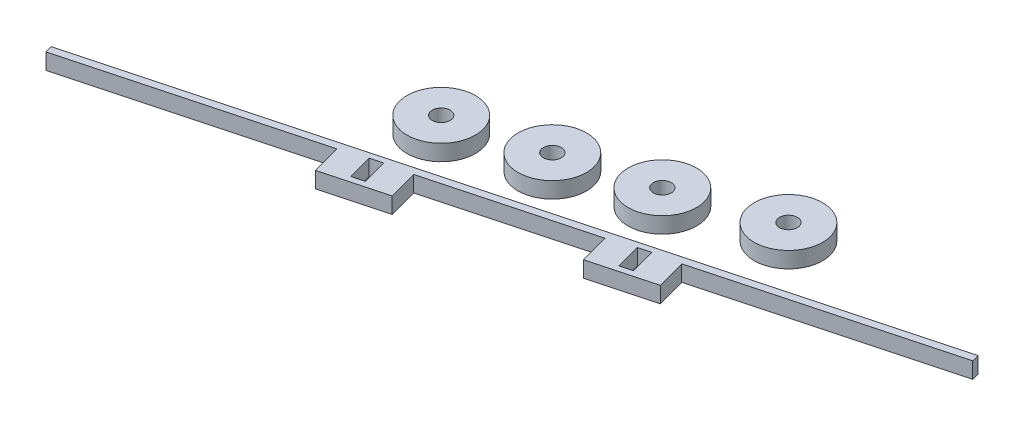
ISO-10303-21;
HEADER;
FILE_DESCRIPTION(('STEP AP214'),'2;1');
FILE_NAME('part.step','',(''),(''),'','','');
FILE_SCHEMA(('AUTOMOTIVE_DESIGN { 1 0 10303 214 1 1 1 1 }'));
ENDSEC;
DATA;
#1=APPLICATION_CONTEXT('core data for automotive mechanical design processes');
#2=APPLICATION_PROTOCOL_DEFINITION('international standard','automotive_design',2000,#1);
#3=PRODUCT_CONTEXT('',#1,'mechanical');
#4=PRODUCT('Part','Part','',(#3));
#5=PRODUCT_RELATED_PRODUCT_CATEGORY('part','',(#4));
#6=PRODUCT_DEFINITION_FORMATION('','',#4);
#7=PRODUCT_DEFINITION_CONTEXT('part definition',#1,'design');
#8=PRODUCT_DEFINITION('design','',#6,#7);
#9=PRODUCT_DEFINITION_SHAPE('','',#8);
#10=(LENGTH_UNIT() NAMED_UNIT(*) SI_UNIT(.MILLI.,.METRE.));
#11=(NAMED_UNIT(*) PLANE_ANGLE_UNIT() SI_UNIT($,.RADIAN.));
#12=(NAMED_UNIT(*) SI_UNIT($,.STERADIAN.) SOLID_ANGLE_UNIT());
#13=UNCERTAINTY_MEASURE_WITH_UNIT(LENGTH_MEASURE(1.E-05),#10,'distance_accuracy_value','');
#14=(GEOMETRIC_REPRESENTATION_CONTEXT(3) GLOBAL_UNCERTAINTY_ASSIGNED_CONTEXT((#13)) GLOBAL_UNIT_ASSIGNED_CONTEXT((#10,
#11,#12)) REPRESENTATION_CONTEXT('',''));
#15=CARTESIAN_POINT('',(0.,0.,0.));
#16=DIRECTION('',(0.,0.,1.));
#17=DIRECTION('',(1.,0.,0.));
#18=AXIS2_PLACEMENT_3D('',#15,#16,#17);
#19=CARTESIAN_POINT('',(-27.7966131715787,2.04191985143892,46.9858592361464));
#20=DIRECTION('',(0.25881904510306,0.,0.965925826288924));
#21=DIRECTION('',(-0.965925826288924,-7.24136028917854E-13,0.25881904510306));
#22=AXIS2_PLACEMENT_3D('',#19,#20,#21);
#23=PLANE('',#22);
#24=DIRECTION('',(0.965925826288924,7.24136028917854E-13,-0.25881904510306));
#25=VECTOR('',#24,1.);
#26=CARTESIAN_POINT('',(-27.7966131715824,7.42191985143892,46.9858592361474));
#27=LINE('',#26,#25);
#28=CARTESIAN_POINT('',(-155.994288836623,7.42191985141612,81.3363229022187));
#29=VERTEX_POINT('',#28);
#30=CARTESIAN_POINT('',(89.2929154911609,7.4219198515267,15.6118145887545));
#31=VERTEX_POINT('',#30);
#32=EDGE_CURVE('E326',#29,#31,#27,.T.);
#33=ORIENTED_EDGE('',*,*,#32,.T.);
#34=DIRECTION('',(-6.99461692078059E-13,1.,1.87420195529241E-13));
#35=VECTOR('',#34,1.);
#36=CARTESIAN_POINT('',(89.2929154911609,7.4219198515267,15.6118145887545));
#37=LINE('',#36,#35);
#38=CARTESIAN_POINT('',(89.2929154911647,2.04191985152669,15.6118145887535));
#39=VERTEX_POINT('',#38);
#40=EDGE_CURVE('E187',#39,#31,#37,.T.);
#41=ORIENTED_EDGE('',*,*,#40,.F.);
#42=DIRECTION('',(0.965925826288924,7.24136028917854E-13,-0.25881904510306));
#43=VECTOR('',#42,1.);
#44=CARTESIAN_POINT('',(-27.7966131715787,2.04191985143892,46.9858592361464));
#45=LINE('',#44,#43);
#46=CARTESIAN_POINT('',(-155.994288836623,2.04191985141612,81.3363229022187));
#47=VERTEX_POINT('',#46);
#48=EDGE_CURVE('E53',#47,#39,#45,.T.);
#49=ORIENTED_EDGE('',*,*,#48,.F.);
#50=DIRECTION('',(0.,-1.,0.));
#51=VECTOR('',#50,1.);
#52=CARTESIAN_POINT('',(-155.994288836623,2.04191985141612,81.3363229022187));
#53=LINE('',#52,#51);
#54=EDGE_CURVE('E185',#29,#47,#53,.T.);
#55=ORIENTED_EDGE('',*,*,#54,.F.);
#56=EDGE_LOOP('',(#33,#41,#49,#55));
#57=FACE_BOUND('',#56,.T.);
#58=ADVANCED_FACE('F45',(#57),#23,.F.);
#59=CARTESIAN_POINT('',(-24.5096112987698,2.04191985143892,59.2531172300158));
#60=DIRECTION('',(-0.25881904510306,0.,-0.965925826288924));
#61=DIRECTION('',(0.965925826288924,7.24136028917854E-13,-0.25881904510306));
#62=AXIS2_PLACEMENT_3D('',#59,#60,#61);
#63=PLANE('',#62);
#64=DIRECTION('',(-0.965925826288924,-7.24136028917854E-13,0.25881904510306));
#65=VECTOR('',#64,1.);
#66=CARTESIAN_POINT('',(-24.5096112987698,2.04191985143892,59.2531172300158));
#67=LINE('',#66,#65);
#68=CARTESIAN_POINT('',(15.5763104922205,2.04191985146897,48.5121268582388));
#69=VERTEX_POINT('',#68);
#70=CARTESIAN_POINT('',(-4.7081318598469,2.04191985145376,53.947326805403));
#71=VERTEX_POINT('',#70);
#72=EDGE_CURVE('E12',#69,#71,#67,.T.);
#73=ORIENTED_EDGE('',*,*,#72,.F.);
#74=DIRECTION('',(6.99461692078059E-13,-1.,-1.87420195529241E-13));
#75=VECTOR('',#74,1.);
#76=CARTESIAN_POINT('',(15.5763104922168,7.42191985146897,48.5121268582398));
#77=LINE('',#76,#75);
#78=CARTESIAN_POINT('',(15.5763104922168,7.42191985146897,48.5121268582398));
#79=VERTEX_POINT('',#78);
#80=EDGE_CURVE('E316',#79,#69,#77,.T.);
#81=ORIENTED_EDGE('',*,*,#80,.F.);
#82=DIRECTION('',(-0.965925826288924,-7.24136028917854E-13,0.25881904510306));
#83=VECTOR('',#82,1.);
#84=CARTESIAN_POINT('',(-24.5096112987736,7.42191985143892,59.2531172300168));
#85=LINE('',#84,#83);
#86=CARTESIAN_POINT('',(-4.70813185985065,7.42191985145376,53.9473268054041));
#87=VERTEX_POINT('',#86);
#88=EDGE_CURVE('E48',#79,#87,#85,.T.);
#89=ORIENTED_EDGE('',*,*,#88,.T.);
#90=DIRECTION('',(-6.99461692078059E-13,1.,1.87420195529241E-13));
#91=VECTOR('',#90,1.);
#92=CARTESIAN_POINT('',(-4.70813185985065,7.42191985145376,53.9473268054041));
#93=LINE('',#92,#91);
#94=EDGE_CURVE('E306',#71,#87,#93,.T.);
#95=ORIENTED_EDGE('',*,*,#94,.F.);
#96=EDGE_LOOP('',(#73,#81,#89,#95));
#97=FACE_BOUND('',#96,.T.);
#98=ADVANCED_FACE('F346',(#97),#63,.F.);
#99=CARTESIAN_POINT('',(-24.5096112987698,2.04191985143892,59.2531172300158));
#100=DIRECTION('',(6.99461692078059E-13,-1.,-1.87420195529241E-13));
#101=DIRECTION('',(0.25881904510306,0.,0.965925826288924));
#102=AXIS2_PLACEMENT_3D('',#99,#100,#101);
#103=PLANE('',#102);
#104=DIRECTION('',(-0.25881904510306,0.,-0.965925826288924));
#105=VECTOR('',#104,1.);
#106=CARTESIAN_POINT('',(0.73287388100622,2.04191985145991,41.4119585807355));
#107=LINE('',#106,#105);
#108=CARTESIAN_POINT('',(2.98459957340285,2.04191985145991,49.8155132694492));
#109=VERTEX_POINT('',#108);
#110=CARTESIAN_POINT('',(0.73287388100622,2.04191985145991,41.4119585807355));
#111=VERTEX_POINT('',#110);
#112=EDGE_CURVE('E61',#109,#111,#107,.T.);
#113=ORIENTED_EDGE('',*,*,#112,.F.);
#114=DIRECTION('',(-0.965925826288924,-7.24136028917854E-13,0.25881904510306));
#115=VECTOR('',#114,1.);
#116=CARTESIAN_POINT('',(2.98459957340285,2.04191985145991,49.8155132694492));
#117=LINE('',#116,#115);
#118=CARTESIAN_POINT('',(6.84830287855854,2.04191985146281,48.7802370890369));
#119=VERTEX_POINT('',#118);
#120=EDGE_CURVE('E287',#119,#109,#117,.T.);
#121=ORIENTED_EDGE('',*,*,#120,.F.);
#122=DIRECTION('',(0.25881904510306,0.,0.965925826288924));
#123=VECTOR('',#122,1.);
#124=CARTESIAN_POINT('',(4.59657718616192,2.04191985146281,40.3766824003233));
#125=LINE('',#124,#123);
#126=CARTESIAN_POINT('',(4.59657718616192,2.04191985146281,40.3766824003233));
#127=VERTEX_POINT('',#126);
#128=EDGE_CURVE('E299',#127,#119,#125,.T.);
#129=ORIENTED_EDGE('',*,*,#128,.F.);
#130=DIRECTION('',(0.965925826288924,7.24136028917854E-13,-0.25881904510306));
#131=VECTOR('',#130,1.);
#132=CARTESIAN_POINT('',(0.73287388100622,2.04191985145991,41.4119585807355));
#133=LINE('',#132,#131);
#134=EDGE_CURVE('E296',#111,#127,#133,.T.);
#135=ORIENTED_EDGE('',*,*,#134,.F.);
#136=EDGE_LOOP('',(#113,#121,#129,#135));
#137=FACE_BOUND('',#136,.T.);
#138=DIRECTION('',(0.25881904510306,0.,0.965925826288924));
#139=VECTOR('',#138,1.);
#140=CARTESIAN_POINT('',(12.9467089939734,2.04191985146897,38.6983204631433));
#141=LINE('',#140,#139);
#142=CARTESIAN_POINT('',(12.9467089939734,2.04191985146897,38.6983204631433));
#143=VERTEX_POINT('',#142);
#144=EDGE_CURVE('E324',#143,#69,#141,.T.);
#145=ORIENTED_EDGE('',*,*,#144,.T.);
#146=ORIENTED_EDGE('',*,*,#72,.T.);
#147=DIRECTION('',(0.25881904510306,0.,0.965925826288924));
#148=VECTOR('',#147,1.);
#149=CARTESIAN_POINT('',(-7.33773335809399,2.04191985145376,44.1335204103076));
#150=LINE('',#149,#148);
#151=CARTESIAN_POINT('',(-7.33773335809399,2.04191985145376,44.1335204103076));
#152=VERTEX_POINT('',#151);
#153=EDGE_CURVE('E323',#152,#71,#150,.T.);
#154=ORIENTED_EDGE('',*,*,#153,.F.);
#155=DIRECTION('',(0.965925826288924,7.24136028917854E-13,-0.25881904510306));
#156=VECTOR('',#155,1.);
#157=CARTESIAN_POINT('',(-7.33773335809399,2.04191985145376,44.1335204103076));
#158=LINE('',#157,#156);
#159=CARTESIAN_POINT('',(-58.0488392382406,2.04191985141612,57.7215202782124));
#160=VERTEX_POINT('',#159);
#161=EDGE_CURVE('E332',#160,#152,#158,.T.);
#162=ORIENTED_EDGE('',*,*,#161,.F.);
#163=DIRECTION('',(0.25881904510306,0.,0.965925826288924));
#164=VECTOR('',#163,1.);
#165=CARTESIAN_POINT('',(-58.0488392382406,2.04191985141612,57.7215202782124));
#166=LINE('',#165,#164);
#167=CARTESIAN_POINT('',(-55.4192377399935,2.04191985141612,67.5353266733078));
#168=VERTEX_POINT('',#167);
#169=EDGE_CURVE('E264',#160,#168,#166,.T.);
#170=ORIENTED_EDGE('',*,*,#169,.T.);
#171=DIRECTION('',(0.965925826288924,0.,-0.25881904510306));
#172=VECTOR('',#171,1.);
#173=CARTESIAN_POINT('',(-35.6177583010706,2.04191985141612,62.2295362486951));
#174=LINE('',#173,#172);
#175=CARTESIAN_POINT('',(-75.7036800920609,2.04191985141612,72.9705266204721));
#176=VERTEX_POINT('',#175);
#177=EDGE_CURVE('E259',#176,#168,#174,.T.);
#178=ORIENTED_EDGE('',*,*,#177,.F.);
#179=DIRECTION('',(0.25881904510306,0.,0.965925826288924));
#180=VECTOR('',#179,1.);
#181=CARTESIAN_POINT('',(-78.333281590308,2.04191985141612,63.1567202253766));
#182=LINE('',#181,#180);
#183=CARTESIAN_POINT('',(-78.333281590308,2.04191985141612,63.1567202253766));
#184=VERTEX_POINT('',#183);
#185=EDGE_CURVE('E253',#184,#176,#182,.T.);
#186=ORIENTED_EDGE('',*,*,#185,.F.);
#187=DIRECTION('',(0.965925826288924,0.,-0.25881904510306));
#188=VECTOR('',#187,1.);
#189=CARTESIAN_POINT('',(-98.134761029231,2.04191985141612,68.4625106499894));
#190=LINE('',#189,#188);
#191=CARTESIAN_POINT('',(-155.336888462061,2.04191985141612,83.7897745009926));
#192=VERTEX_POINT('',#191);
#193=EDGE_CURVE('E199',#192,#184,#190,.T.);
#194=ORIENTED_EDGE('',*,*,#193,.F.);
#195=DIRECTION('',(0.25881904510306,0.,0.965925826288924));
#196=VECTOR('',#195,1.);
#197=CARTESIAN_POINT('',(-155.994288836623,2.04191985141612,81.3363229022187));
#198=LINE('',#197,#196);
#199=EDGE_CURVE('E193',#47,#192,#198,.T.);
#200=ORIENTED_EDGE('',*,*,#199,.F.);
#201=ORIENTED_EDGE('',*,*,#48,.T.);
#202=DIRECTION('',(-0.25881904510306,0.,-0.965925826288924));
#203=VECTOR('',#202,1.);
#204=CARTESIAN_POINT('',(89.2929154911647,2.04191985152669,15.6118145887535));
#205=LINE('',#204,#203);
#206=CARTESIAN_POINT('',(89.9503158657265,2.04191985152669,18.0652661875273));
#207=VERTEX_POINT('',#206);
#208=EDGE_CURVE('E281',#207,#39,#205,.T.);
#209=ORIENTED_EDGE('',*,*,#208,.F.);
#210=DIRECTION('',(0.965925826288924,7.24136028917854E-13,-0.25881904510306));
#211=VECTOR('',#210,1.);
#212=CARTESIAN_POINT('',(32.7481884328964,2.04191985148381,33.3925300385306));
#213=LINE('',#212,#211);
#214=EDGE_CURVE('E319',#143,#207,#213,.T.);
#215=ORIENTED_EDGE('',*,*,#214,.F.);
#216=EDGE_LOOP('',(#145,#146,#154,#162,#170,#178,#186,#194,#200,#201,#209,#215));
#217=FACE_BOUND('',#216,.T.);
#218=DIRECTION('',(0.965925826288924,0.,-0.25881904510306));
#219=VECTOR('',#218,1.);
#220=CARTESIAN_POINT('',(-64.1472453536555,2.04191985141612,67.803436904106));
#221=LINE('',#220,#219);
#222=CARTESIAN_POINT('',(-68.0109486588112,2.04191985141612,68.8387130845182));
#223=VERTEX_POINT('',#222);
#224=CARTESIAN_POINT('',(-64.1472453536555,2.04191985141612,67.803436904106));
#225=VERTEX_POINT('',#224);
#226=EDGE_CURVE('E224',#223,#225,#221,.T.);
#227=ORIENTED_EDGE('',*,*,#226,.T.);
#228=DIRECTION('',(-0.25881904510306,0.,-0.965925826288924));
#229=VECTOR('',#228,1.);
#230=CARTESIAN_POINT('',(-66.3989710460521,2.04191985141612,59.3998822153924));
#231=LINE('',#230,#229);
#232=CARTESIAN_POINT('',(-66.3989710460521,2.04191985141612,59.3998822153924));
#233=VERTEX_POINT('',#232);
#234=EDGE_CURVE('E214',#225,#233,#231,.T.);
#235=ORIENTED_EDGE('',*,*,#234,.T.);
#236=DIRECTION('',(-0.965925826288924,0.,0.25881904510306));
#237=VECTOR('',#236,1.);
#238=CARTESIAN_POINT('',(-66.3989710460521,2.04191985141612,59.3998822153924));
#239=LINE('',#238,#237);
#240=CARTESIAN_POINT('',(-70.2626743512078,2.04191985141612,60.4351583958046));
#241=VERTEX_POINT('',#240);
#242=EDGE_CURVE('E217',#233,#241,#239,.T.);
#243=ORIENTED_EDGE('',*,*,#242,.T.);
#244=DIRECTION('',(0.25881904510306,0.,0.965925826288924));
#245=VECTOR('',#244,1.);
#246=CARTESIAN_POINT('',(-70.2626743512078,2.04191985141612,60.4351583958046));
#247=LINE('',#246,#245);
#248=EDGE_CURVE('E221',#241,#223,#247,.T.);
#249=ORIENTED_EDGE('',*,*,#248,.T.);
#250=EDGE_LOOP('',(#227,#235,#243,#249));
#251=FACE_BOUND('',#250,.T.);
#252=ADVANCED_FACE('F195',(#137,#217,#251),#103,.T.);
#253=CARTESIAN_POINT('',(-24.5096112987736,7.42191985143892,59.2531172300168));
#254=DIRECTION('',(6.99461692078059E-13,-1.,-1.87420195529241E-13));
#255=DIRECTION('',(0.25881904510306,0.,0.965925826288924));
#256=AXIS2_PLACEMENT_3D('',#253,#254,#255);
#257=PLANE('',#256);
#258=DIRECTION('',(-0.965925826288924,-7.24136028917854E-13,0.25881904510306));
#259=VECTOR('',#258,1.);
#260=CARTESIAN_POINT('',(2.98459957339908,7.42191985145992,49.8155132694502));
#261=LINE('',#260,#259);
#262=CARTESIAN_POINT('',(6.84830287855478,7.42191985146282,48.7802370890379));
#263=VERTEX_POINT('',#262);
#264=CARTESIAN_POINT('',(2.98459957339908,7.42191985145992,49.8155132694502));
#265=VERTEX_POINT('',#264);
#266=EDGE_CURVE('E291',#263,#265,#261,.T.);
#267=ORIENTED_EDGE('',*,*,#266,.T.);
#268=DIRECTION('',(-0.25881904510306,0.,-0.965925826288924));
#269=VECTOR('',#268,1.);
#270=CARTESIAN_POINT('',(0.732873881002452,7.42191985145992,41.4119585807366));
#271=LINE('',#270,#269);
#272=CARTESIAN_POINT('',(0.732873881002452,7.42191985145992,41.4119585807366));
#273=VERTEX_POINT('',#272);
#274=EDGE_CURVE('E283',#265,#273,#271,.T.);
#275=ORIENTED_EDGE('',*,*,#274,.T.);
#276=DIRECTION('',(0.965925826288924,7.24136028917854E-13,-0.25881904510306));
#277=VECTOR('',#276,1.);
#278=CARTESIAN_POINT('',(0.732873881002452,7.42191985145992,41.4119585807366));
#279=LINE('',#278,#277);
#280=CARTESIAN_POINT('',(4.59657718615815,7.42191985146282,40.3766824003243));
#281=VERTEX_POINT('',#280);
#282=EDGE_CURVE('E286',#273,#281,#279,.T.);
#283=ORIENTED_EDGE('',*,*,#282,.T.);
#284=DIRECTION('',(0.25881904510306,0.,0.965925826288924));
#285=VECTOR('',#284,1.);
#286=CARTESIAN_POINT('',(4.59657718615815,7.42191985146282,40.3766824003243));
#287=LINE('',#286,#285);
#288=EDGE_CURVE('E69',#281,#263,#287,.T.);
#289=ORIENTED_EDGE('',*,*,#288,.T.);
#290=EDGE_LOOP('',(#267,#275,#283,#289));
#291=FACE_BOUND('',#290,.T.);
#292=ORIENTED_EDGE('',*,*,#88,.F.);
#293=DIRECTION('',(0.25881904510306,0.,0.965925826288924));
#294=VECTOR('',#293,1.);
#295=CARTESIAN_POINT('',(12.9467089939697,7.42191985146897,38.6983204631443));
#296=LINE('',#295,#294);
#297=CARTESIAN_POINT('',(12.9467089939697,7.42191985146897,38.6983204631443));
#298=VERTEX_POINT('',#297);
#299=EDGE_CURVE('E321',#298,#79,#296,.T.);
#300=ORIENTED_EDGE('',*,*,#299,.F.);
#301=DIRECTION('',(-0.965925826288924,-7.24136028917854E-13,0.25881904510306));
#302=VECTOR('',#301,1.);
#303=CARTESIAN_POINT('',(32.7481884328926,7.42191985148381,33.3925300385316));
#304=LINE('',#303,#302);
#305=CARTESIAN_POINT('',(89.9503158657227,7.4219198515267,18.0652661875284));
#306=VERTEX_POINT('',#305);
#307=EDGE_CURVE('E312',#306,#298,#304,.T.);
#308=ORIENTED_EDGE('',*,*,#307,.F.);
#309=DIRECTION('',(0.25881904510306,0.,0.965925826288924));
#310=VECTOR('',#309,1.);
#311=CARTESIAN_POINT('',(89.2929154911609,7.4219198515267,15.6118145887545));
#312=LINE('',#311,#310);
#313=EDGE_CURVE('E275',#31,#306,#312,.T.);
#314=ORIENTED_EDGE('',*,*,#313,.F.);
#315=ORIENTED_EDGE('',*,*,#32,.F.);
#316=DIRECTION('',(-0.25881904510306,0.,-0.965925826288924));
#317=VECTOR('',#316,1.);
#318=CARTESIAN_POINT('',(-155.994288836623,7.42191985141612,81.3363229022187));
#319=LINE('',#318,#317);
#320=CARTESIAN_POINT('',(-155.336888462061,7.42191985141612,83.7897745009926));
#321=VERTEX_POINT('',#320);
#322=EDGE_CURVE('E208',#321,#29,#319,.T.);
#323=ORIENTED_EDGE('',*,*,#322,.F.);
#324=DIRECTION('',(-0.965925826288924,0.,0.25881904510306));
#325=VECTOR('',#324,1.);
#326=CARTESIAN_POINT('',(-98.134761029231,7.42191985141612,68.4625106499894));
#327=LINE('',#326,#325);
#328=CARTESIAN_POINT('',(-78.333281590308,7.42191985141612,63.1567202253766));
#329=VERTEX_POINT('',#328);
#330=EDGE_CURVE('E251',#329,#321,#327,.T.);
#331=ORIENTED_EDGE('',*,*,#330,.F.);
#332=DIRECTION('',(0.25881904510306,0.,0.965925826288924));
#333=VECTOR('',#332,1.);
#334=CARTESIAN_POINT('',(-78.333281590308,7.42191985141612,63.1567202253766));
#335=LINE('',#334,#333);
#336=CARTESIAN_POINT('',(-75.7036800920609,7.42191985141612,72.9705266204721));
#337=VERTEX_POINT('',#336);
#338=EDGE_CURVE('E256',#329,#337,#335,.T.);
#339=ORIENTED_EDGE('',*,*,#338,.T.);
#340=DIRECTION('',(0.965925826288924,0.,-0.25881904510306));
#341=VECTOR('',#340,1.);
#342=CARTESIAN_POINT('',(-35.6177583010706,7.42191985141612,62.2295362486951));
#343=LINE('',#342,#341);
#344=CARTESIAN_POINT('',(-55.4192377399935,7.42191985141612,67.5353266733078));
#345=VERTEX_POINT('',#344);
#346=EDGE_CURVE('E269',#337,#345,#343,.T.);
#347=ORIENTED_EDGE('',*,*,#346,.T.);
#348=DIRECTION('',(0.25881904510306,0.,0.965925826288924));
#349=VECTOR('',#348,1.);
#350=CARTESIAN_POINT('',(-58.0488392382406,7.42191985141612,57.7215202782124));
#351=LINE('',#350,#349);
#352=CARTESIAN_POINT('',(-58.0488392382406,7.42191985141612,57.7215202782124));
#353=VERTEX_POINT('',#352);
#354=EDGE_CURVE('E255',#353,#345,#351,.T.);
#355=ORIENTED_EDGE('',*,*,#354,.F.);
#356=DIRECTION('',(-0.965925826288924,-7.24136028917854E-13,0.25881904510306));
#357=VECTOR('',#356,1.);
#358=CARTESIAN_POINT('',(-7.33773335809774,7.42191985145376,44.1335204103086));
#359=LINE('',#358,#357);
#360=CARTESIAN_POINT('',(-7.33773335809774,7.42191985145376,44.1335204103086));
#361=VERTEX_POINT('',#360);
#362=EDGE_CURVE('E330',#361,#353,#359,.T.);
#363=ORIENTED_EDGE('',*,*,#362,.F.);
#364=DIRECTION('',(0.25881904510306,0.,0.965925826288924));
#365=VECTOR('',#364,1.);
#366=CARTESIAN_POINT('',(-7.33773335809774,7.42191985145376,44.1335204103086));
#367=LINE('',#366,#365);
#368=EDGE_CURVE('E335',#361,#87,#367,.T.);
#369=ORIENTED_EDGE('',*,*,#368,.T.);
#370=EDGE_LOOP('',(#292,#300,#308,#314,#315,#323,#331,#339,#347,#355,#363,#369));
#371=FACE_BOUND('',#370,.T.);
#372=DIRECTION('',(-0.25881904510306,0.,-0.965925826288924));
#373=VECTOR('',#372,1.);
#374=CARTESIAN_POINT('',(-66.3989710460521,7.42191985141612,59.3998822153924));
#375=LINE('',#374,#373);
#376=CARTESIAN_POINT('',(-64.1472453536555,7.42191985141612,67.803436904106));
#377=VERTEX_POINT('',#376);
#378=CARTESIAN_POINT('',(-66.3989710460521,7.42191985141612,59.3998822153924));
#379=VERTEX_POINT('',#378);
#380=EDGE_CURVE('E213',#377,#379,#375,.T.);
#381=ORIENTED_EDGE('',*,*,#380,.F.);
#382=DIRECTION('',(0.965925826288924,0.,-0.25881904510306));
#383=VECTOR('',#382,1.);
#384=CARTESIAN_POINT('',(-64.1472453536555,7.42191985141612,67.803436904106));
#385=LINE('',#384,#383);
#386=CARTESIAN_POINT('',(-68.0109486588112,7.42191985141612,68.8387130845182));
#387=VERTEX_POINT('',#386);
#388=EDGE_CURVE('E218',#387,#377,#385,.T.);
#389=ORIENTED_EDGE('',*,*,#388,.F.);
#390=DIRECTION('',(0.25881904510306,0.,0.965925826288924));
#391=VECTOR('',#390,1.);
#392=CARTESIAN_POINT('',(-70.2626743512078,7.42191985141612,60.4351583958046));
#393=LINE('',#392,#391);
#394=CARTESIAN_POINT('',(-70.2626743512078,7.42191985141612,60.4351583958046));
#395=VERTEX_POINT('',#394);
#396=EDGE_CURVE('E232',#395,#387,#393,.T.);
#397=ORIENTED_EDGE('',*,*,#396,.F.);
#398=DIRECTION('',(-0.965925826288924,0.,0.25881904510306));
#399=VECTOR('',#398,1.);
#400=CARTESIAN_POINT('',(-66.3989710460521,7.42191985141612,59.3998822153924));
#401=LINE('',#400,#399);
#402=EDGE_CURVE('E229',#379,#395,#401,.T.);
#403=ORIENTED_EDGE('',*,*,#402,.F.);
#404=EDGE_LOOP('',(#381,#389,#397,#403));
#405=FACE_BOUND('',#404,.T.);
#406=ADVANCED_FACE('F349',(#291,#371,#405),#257,.F.);
#407=CARTESIAN_POINT('',(-7.33773335809774,7.42191985145376,44.1335204103086));
#408=DIRECTION('',(0.965925826288924,7.24136028917854E-13,-0.25881904510306));
#409=DIRECTION('',(0.25881904510306,0.,0.965925826288924));
#410=AXIS2_PLACEMENT_3D('',#407,#408,#409);
#411=PLANE('',#410);
#412=ORIENTED_EDGE('',*,*,#94,.T.);
#413=ORIENTED_EDGE('',*,*,#368,.F.);
#414=DIRECTION('',(-6.99461692078059E-13,1.,1.87420195529241E-13));
#415=VECTOR('',#414,1.);
#416=CARTESIAN_POINT('',(-7.33773335809774,7.42191985145376,44.1335204103086));
#417=LINE('',#416,#415);
#418=EDGE_CURVE('E328',#152,#361,#417,.T.);
#419=ORIENTED_EDGE('',*,*,#418,.F.);
#420=ORIENTED_EDGE('',*,*,#153,.T.);
#421=EDGE_LOOP('',(#412,#413,#419,#420));
#422=FACE_BOUND('',#421,.T.);
#423=ADVANCED_FACE('F355',(#422),#411,.F.);
#424=CARTESIAN_POINT('',(-27.1392127970207,7.42191985143892,49.4393108349213));
#425=DIRECTION('',(-0.25881904510306,0.,-0.965925826288924));
#426=DIRECTION('',(0.965925826288924,7.24136028917854E-13,-0.25881904510306));
#427=AXIS2_PLACEMENT_3D('',#424,#425,#426);
#428=PLANE('',#427);
#429=ORIENTED_EDGE('',*,*,#418,.T.);
#430=ORIENTED_EDGE('',*,*,#362,.T.);
#431=DIRECTION('',(0.,-1.,0.));
#432=VECTOR('',#431,1.);
#433=CARTESIAN_POINT('',(-58.0488392382406,2.04191985141612,57.7215202782124));
#434=LINE('',#433,#432);
#435=EDGE_CURVE('E261',#353,#160,#434,.T.);
#436=ORIENTED_EDGE('',*,*,#435,.T.);
#437=ORIENTED_EDGE('',*,*,#161,.T.);
#438=EDGE_LOOP('',(#429,#430,#436,#437));
#439=FACE_BOUND('',#438,.T.);
#440=ADVANCED_FACE('F395',(#439),#428,.F.);
#441=CARTESIAN_POINT('',(12.9467089939697,7.42191985146897,38.6983204631443));
#442=DIRECTION('',(-0.965925826288924,-7.24136028917854E-13,0.25881904510306));
#443=DIRECTION('',(-0.25881904510306,0.,-0.965925826288924));
#444=AXIS2_PLACEMENT_3D('',#441,#442,#443);
#445=PLANE('',#444);
#446=ORIENTED_EDGE('',*,*,#80,.T.);
#447=ORIENTED_EDGE('',*,*,#144,.F.);
#448=DIRECTION('',(6.99461692078059E-13,-1.,-1.87420195529241E-13));
#449=VECTOR('',#448,1.);
#450=CARTESIAN_POINT('',(12.9467089939697,7.42191985146897,38.6983204631443));
#451=LINE('',#450,#449);
#452=EDGE_CURVE('E315',#298,#143,#451,.T.);
#453=ORIENTED_EDGE('',*,*,#452,.F.);
#454=ORIENTED_EDGE('',*,*,#299,.T.);
#455=EDGE_LOOP('',(#446,#447,#453,#454));
#456=FACE_BOUND('',#455,.T.);
#457=ADVANCED_FACE('F359',(#456),#445,.F.);
#458=CARTESIAN_POINT('',(-27.1392127970207,7.42191985143892,49.4393108349213));
#459=DIRECTION('',(-0.25881904510306,0.,-0.965925826288924));
#460=DIRECTION('',(0.965925826288924,7.24136028917854E-13,-0.25881904510306));
#461=AXIS2_PLACEMENT_3D('',#458,#459,#460);
#462=PLANE('',#461);
#463=ORIENTED_EDGE('',*,*,#214,.T.);
#464=DIRECTION('',(6.99461692078059E-13,-1.,-1.87420195529241E-13));
#465=VECTOR('',#464,1.);
#466=CARTESIAN_POINT('',(89.9503158657227,7.4219198515267,18.0652661875284));
#467=LINE('',#466,#465);
#468=EDGE_CURVE('E278',#306,#207,#467,.T.);
#469=ORIENTED_EDGE('',*,*,#468,.F.);
#470=ORIENTED_EDGE('',*,*,#307,.T.);
#471=ORIENTED_EDGE('',*,*,#452,.T.);
#472=EDGE_LOOP('',(#463,#469,#470,#471));
#473=FACE_BOUND('',#472,.T.);
#474=ADVANCED_FACE('F361',(#473),#462,.F.);
#475=CARTESIAN_POINT('',(0.732873881002452,7.42191985145992,41.4119585807366));
#476=DIRECTION('',(-0.965925826288924,-7.24136028917854E-13,0.25881904510306));
#477=DIRECTION('',(-0.25881904510306,0.,-0.965925826288924));
#478=AXIS2_PLACEMENT_3D('',#475,#476,#477);
#479=PLANE('',#478);
#480=ORIENTED_EDGE('',*,*,#112,.T.);
#481=DIRECTION('',(6.99461692078059E-13,-1.,-1.87420195529241E-13));
#482=VECTOR('',#481,1.);
#483=CARTESIAN_POINT('',(0.732873881002452,7.42191985145992,41.4119585807366));
#484=LINE('',#483,#482);
#485=EDGE_CURVE('E294',#273,#111,#484,.T.);
#486=ORIENTED_EDGE('',*,*,#485,.F.);
#487=ORIENTED_EDGE('',*,*,#274,.F.);
#488=DIRECTION('',(6.99461692078059E-13,-1.,-1.87420195529241E-13));
#489=VECTOR('',#488,1.);
#490=CARTESIAN_POINT('',(2.98459957339908,7.42191985145992,49.8155132694502));
#491=LINE('',#490,#489);
#492=EDGE_CURVE('E304',#265,#109,#491,.T.);
#493=ORIENTED_EDGE('',*,*,#492,.T.);
#494=EDGE_LOOP('',(#480,#486,#487,#493));
#495=FACE_BOUND('',#494,.T.);
#496=ADVANCED_FACE('F403',(#495),#479,.F.);
#497=CARTESIAN_POINT('',(2.98459957339908,7.42191985145992,49.8155132694502));
#498=DIRECTION('',(0.25881904510306,0.,0.965925826288924));
#499=DIRECTION('',(-0.965925826288924,-7.24136028917854E-13,0.25881904510306));
#500=AXIS2_PLACEMENT_3D('',#497,#498,#499);
#501=PLANE('',#500);
#502=ORIENTED_EDGE('',*,*,#120,.T.);
#503=ORIENTED_EDGE('',*,*,#492,.F.);
#504=ORIENTED_EDGE('',*,*,#266,.F.);
#505=DIRECTION('',(6.99461692078059E-13,-1.,-1.87420195529241E-13));
#506=VECTOR('',#505,1.);
#507=CARTESIAN_POINT('',(6.84830287855478,7.42191985146282,48.7802370890379));
#508=LINE('',#507,#506);
#509=EDGE_CURVE('E307',#263,#119,#508,.T.);
#510=ORIENTED_EDGE('',*,*,#509,.T.);
#511=EDGE_LOOP('',(#502,#503,#504,#510));
#512=FACE_BOUND('',#511,.T.);
#513=ADVANCED_FACE('F405',(#512),#501,.F.);
#514=CARTESIAN_POINT('',(4.59657718615815,7.42191985146282,40.3766824003243));
#515=DIRECTION('',(0.965925826288924,7.24136028917854E-13,-0.25881904510306));
#516=DIRECTION('',(0.25881904510306,0.,0.965925826288924));
#517=AXIS2_PLACEMENT_3D('',#514,#515,#516);
#518=PLANE('',#517);
#519=ORIENTED_EDGE('',*,*,#128,.T.);
#520=ORIENTED_EDGE('',*,*,#509,.F.);
#521=ORIENTED_EDGE('',*,*,#288,.F.);
#522=DIRECTION('',(6.99461692078059E-13,-1.,-1.87420195529241E-13));
#523=VECTOR('',#522,1.);
#524=CARTESIAN_POINT('',(4.59657718615815,7.42191985146282,40.3766824003243));
#525=LINE('',#524,#523);
#526=EDGE_CURVE('E309',#281,#127,#525,.T.);
#527=ORIENTED_EDGE('',*,*,#526,.T.);
#528=EDGE_LOOP('',(#519,#520,#521,#527));
#529=FACE_BOUND('',#528,.T.);
#530=ADVANCED_FACE('F376',(#529),#518,.F.);
#531=CARTESIAN_POINT('',(0.732873881002452,7.42191985145992,41.4119585807366));
#532=DIRECTION('',(-0.25881904510306,0.,-0.965925826288924));
#533=DIRECTION('',(0.965925826288924,7.24136028917854E-13,-0.25881904510306));
#534=AXIS2_PLACEMENT_3D('',#531,#532,#533);
#535=PLANE('',#534);
#536=ORIENTED_EDGE('',*,*,#134,.T.);
#537=ORIENTED_EDGE('',*,*,#526,.F.);
#538=ORIENTED_EDGE('',*,*,#282,.F.);
#539=ORIENTED_EDGE('',*,*,#485,.T.);
#540=EDGE_LOOP('',(#536,#537,#538,#539));
#541=FACE_BOUND('',#540,.T.);
#542=ADVANCED_FACE('F367',(#541),#535,.F.);
#543=CARTESIAN_POINT('',(92.5799173639698,7.4219198515267,27.8790725826238));
#544=DIRECTION('',(-0.965925826288924,-7.24136028917854E-13,0.25881904510306));
#545=DIRECTION('',(-0.25881904510306,0.,-0.965925826288924));
#546=AXIS2_PLACEMENT_3D('',#543,#544,#545);
#547=PLANE('',#546);
#548=ORIENTED_EDGE('',*,*,#40,.T.);
#549=ORIENTED_EDGE('',*,*,#313,.T.);
#550=ORIENTED_EDGE('',*,*,#468,.T.);
#551=ORIENTED_EDGE('',*,*,#208,.T.);
#552=EDGE_LOOP('',(#548,#549,#550,#551));
#553=FACE_BOUND('',#552,.T.);
#554=ADVANCED_FACE('F364',(#553),#547,.F.);
#555=CARTESIAN_POINT('',(-35.6177583010706,7.42191985141612,62.2295362486951));
#556=DIRECTION('',(-0.25881904510306,0.,-0.965925826288924));
#557=DIRECTION('',(-0.965925826288924,0.,0.25881904510306));
#558=AXIS2_PLACEMENT_3D('',#555,#556,#557);
#559=PLANE('',#558);
#560=ORIENTED_EDGE('',*,*,#346,.F.);
#561=DIRECTION('',(0.,1.,0.));
#562=VECTOR('',#561,1.);
#563=CARTESIAN_POINT('',(-75.7036800920609,2.04191985141612,72.9705266204721));
#564=LINE('',#563,#562);
#565=EDGE_CURVE('E248',#176,#337,#564,.T.);
#566=ORIENTED_EDGE('',*,*,#565,.F.);
#567=ORIENTED_EDGE('',*,*,#177,.T.);
#568=DIRECTION('',(0.,-1.,0.));
#569=VECTOR('',#568,1.);
#570=CARTESIAN_POINT('',(-55.4192377399935,2.04191985141612,67.5353266733078));
#571=LINE('',#570,#569);
#572=EDGE_CURVE('E239',#345,#168,#571,.T.);
#573=ORIENTED_EDGE('',*,*,#572,.F.);
#574=EDGE_LOOP('',(#560,#566,#567,#573));
#575=FACE_BOUND('',#574,.T.);
#576=ADVANCED_FACE('F366',(#575),#559,.F.);
#577=CARTESIAN_POINT('',(-58.0488392382406,2.04191985141612,57.7215202782124));
#578=DIRECTION('',(-0.965925826288924,0.,0.25881904510306));
#579=DIRECTION('',(0.25881904510306,0.,0.965925826288924));
#580=AXIS2_PLACEMENT_3D('',#577,#578,#579);
#581=PLANE('',#580);
#582=ORIENTED_EDGE('',*,*,#572,.T.);
#583=ORIENTED_EDGE('',*,*,#169,.F.);
#584=ORIENTED_EDGE('',*,*,#435,.F.);
#585=ORIENTED_EDGE('',*,*,#354,.T.);
#586=EDGE_LOOP('',(#582,#583,#584,#585));
#587=FACE_BOUND('',#586,.T.);
#588=ADVANCED_FACE('F373',(#587),#581,.F.);
#589=CARTESIAN_POINT('',(-78.333281590308,2.04191985141612,63.1567202253766));
#590=DIRECTION('',(0.965925826288924,0.,-0.25881904510306));
#591=DIRECTION('',(-0.25881904510306,0.,-0.965925826288924));
#592=AXIS2_PLACEMENT_3D('',#589,#590,#591);
#593=PLANE('',#592);
#594=ORIENTED_EDGE('',*,*,#565,.T.);
#595=ORIENTED_EDGE('',*,*,#338,.F.);
#596=DIRECTION('',(0.,1.,0.));
#597=VECTOR('',#596,1.);
#598=CARTESIAN_POINT('',(-78.333281590308,2.04191985141612,63.1567202253766));
#599=LINE('',#598,#597);
#600=EDGE_CURVE('E247',#184,#329,#599,.T.);
#601=ORIENTED_EDGE('',*,*,#600,.F.);
#602=ORIENTED_EDGE('',*,*,#185,.T.);
#603=EDGE_LOOP('',(#594,#595,#601,#602));
#604=FACE_BOUND('',#603,.T.);
#605=ADVANCED_FACE('F448',(#604),#593,.F.);
#606=CARTESIAN_POINT('',(-38.2473597993177,2.04191985141612,52.4157298535996));
#607=DIRECTION('',(-0.25881904510306,0.,-0.965925826288924));
#608=DIRECTION('',(-0.965925826288924,0.,0.25881904510306));
#609=AXIS2_PLACEMENT_3D('',#606,#607,#608);
#610=PLANE('',#609);
#611=ORIENTED_EDGE('',*,*,#330,.T.);
#612=DIRECTION('',(0.,1.,0.));
#613=VECTOR('',#612,1.);
#614=CARTESIAN_POINT('',(-155.336888462061,2.04191985141612,83.7897745009926));
#615=LINE('',#614,#613);
#616=EDGE_CURVE('E203',#192,#321,#615,.T.);
#617=ORIENTED_EDGE('',*,*,#616,.F.);
#618=ORIENTED_EDGE('',*,*,#193,.T.);
#619=ORIENTED_EDGE('',*,*,#600,.T.);
#620=EDGE_LOOP('',(#611,#617,#618,#619));
#621=FACE_BOUND('',#620,.T.);
#622=ADVANCED_FACE('F458',(#621),#610,.F.);
#623=CARTESIAN_POINT('',(-66.3989710460521,2.04191985141612,59.3998822153924));
#624=DIRECTION('',(0.965925826288924,0.,-0.25881904510306));
#625=DIRECTION('',(-0.25881904510306,0.,-0.965925826288924));
#626=AXIS2_PLACEMENT_3D('',#623,#624,#625);
#627=PLANE('',#626);
#628=ORIENTED_EDGE('',*,*,#380,.T.);
#629=DIRECTION('',(0.,1.,0.));
#630=VECTOR('',#629,1.);
#631=CARTESIAN_POINT('',(-66.3989710460521,2.04191985141612,59.3998822153924));
#632=LINE('',#631,#630);
#633=EDGE_CURVE('E227',#233,#379,#632,.T.);
#634=ORIENTED_EDGE('',*,*,#633,.F.);
#635=ORIENTED_EDGE('',*,*,#234,.F.);
#636=DIRECTION('',(0.,1.,0.));
#637=VECTOR('',#636,1.);
#638=CARTESIAN_POINT('',(-64.1472453536555,2.04191985141612,67.803436904106));
#639=LINE('',#638,#637);
#640=EDGE_CURVE('E237',#225,#377,#639,.T.);
#641=ORIENTED_EDGE('',*,*,#640,.T.);
#642=EDGE_LOOP('',(#628,#634,#635,#641));
#643=FACE_BOUND('',#642,.T.);
#644=ADVANCED_FACE('F469',(#643),#627,.F.);
#645=CARTESIAN_POINT('',(-64.1472453536555,2.04191985141612,67.803436904106));
#646=DIRECTION('',(0.25881904510306,0.,0.965925826288924));
#647=DIRECTION('',(0.965925826288924,0.,-0.25881904510306));
#648=AXIS2_PLACEMENT_3D('',#645,#646,#647);
#649=PLANE('',#648);
#650=ORIENTED_EDGE('',*,*,#388,.T.);
#651=ORIENTED_EDGE('',*,*,#640,.F.);
#652=ORIENTED_EDGE('',*,*,#226,.F.);
#653=DIRECTION('',(0.,1.,0.));
#654=VECTOR('',#653,1.);
#655=CARTESIAN_POINT('',(-68.0109486588112,2.04191985141612,68.8387130845182));
#656=LINE('',#655,#654);
#657=EDGE_CURVE('E240',#223,#387,#656,.T.);
#658=ORIENTED_EDGE('',*,*,#657,.T.);
#659=EDGE_LOOP('',(#650,#651,#652,#658));
#660=FACE_BOUND('',#659,.T.);
#661=ADVANCED_FACE('F479',(#660),#649,.F.);
#662=CARTESIAN_POINT('',(-70.2626743512078,2.04191985141612,60.4351583958046));
#663=DIRECTION('',(-0.965925826288924,0.,0.25881904510306));
#664=DIRECTION('',(0.25881904510306,0.,0.965925826288924));
#665=AXIS2_PLACEMENT_3D('',#662,#663,#664);
#666=PLANE('',#665);
#667=ORIENTED_EDGE('',*,*,#396,.T.);
#668=ORIENTED_EDGE('',*,*,#657,.F.);
#669=ORIENTED_EDGE('',*,*,#248,.F.);
#670=DIRECTION('',(0.,1.,0.));
#671=VECTOR('',#670,1.);
#672=CARTESIAN_POINT('',(-70.2626743512078,2.04191985141612,60.4351583958046));
#673=LINE('',#672,#671);
#674=EDGE_CURVE('E242',#241,#395,#673,.T.);
#675=ORIENTED_EDGE('',*,*,#674,.T.);
#676=EDGE_LOOP('',(#667,#668,#669,#675));
#677=FACE_BOUND('',#676,.T.);
#678=ADVANCED_FACE('F489',(#677),#666,.F.);
#679=CARTESIAN_POINT('',(-66.3989710460521,2.04191985141612,59.3998822153924));
#680=DIRECTION('',(-0.25881904510306,0.,-0.965925826288924));
#681=DIRECTION('',(-0.965925826288924,0.,0.25881904510306));
#682=AXIS2_PLACEMENT_3D('',#679,#680,#681);
#683=PLANE('',#682);
#684=ORIENTED_EDGE('',*,*,#402,.T.);
#685=ORIENTED_EDGE('',*,*,#674,.F.);
#686=ORIENTED_EDGE('',*,*,#242,.F.);
#687=ORIENTED_EDGE('',*,*,#633,.T.);
#688=EDGE_LOOP('',(#684,#685,#686,#687));
#689=FACE_BOUND('',#688,.T.);
#690=ADVANCED_FACE('F499',(#689),#683,.F.);
#691=CARTESIAN_POINT('',(-152.707286963814,2.04191985141612,93.6035808960881));
#692=DIRECTION('',(0.965925826288924,0.,-0.25881904510306));
#693=DIRECTION('',(-0.25881904510306,0.,-0.965925826288924));
#694=AXIS2_PLACEMENT_3D('',#691,#692,#693);
#695=PLANE('',#694);
#696=ORIENTED_EDGE('',*,*,#54,.T.);
#697=ORIENTED_EDGE('',*,*,#199,.T.);
#698=ORIENTED_EDGE('',*,*,#616,.T.);
#699=ORIENTED_EDGE('',*,*,#322,.T.);
#700=EDGE_LOOP('',(#696,#697,#698,#699));
#701=FACE_BOUND('',#700,.T.);
#702=ADVANCED_FACE('F206',(#701),#695,.F.);
#703=CLOSED_SHELL('',(#58,#98,#252,#406,#423,#440,#457,#474,#496,#513,#530,#542,#554,#576,#588,
#605,#622,#644,#661,#678,#690,#702));
#704=MANIFOLD_SOLID_BREP('B2',#703);
#705=CARTESIAN_POINT('',(18.8159157184458,7.42191985145771,8.75249249524242));
#706=DIRECTION('',(0.,-1.,0.));
#707=DIRECTION('',(0.,0.,-1.));
#708=AXIS2_PLACEMENT_3D('',#705,#706,#707);
#709=CYLINDRICAL_SURFACE('',#708,11.5);
#710=CARTESIAN_POINT('',(18.8159157184458,7.42191985145771,8.75249249524242));
#711=DIRECTION('',(0.,1.,0.));
#712=DIRECTION('',(0.,0.,1.));
#713=AXIS2_PLACEMENT_3D('',#710,#711,#712);
#714=CIRCLE('',#713,11.5);
#715=CARTESIAN_POINT('',(18.8159157184458,7.42191985145771,20.2524924952424));
#716=VERTEX_POINT('',#715);
#717=EDGE_CURVE('E44',#716,#716,#714,.T.);
#718=ORIENTED_EDGE('',*,*,#717,.F.);
#719=EDGE_LOOP('',(#718));
#720=FACE_BOUND('',#719,.T.);
#721=CARTESIAN_POINT('',(18.8159157184458,2.04191985145771,8.75249249524242));
#722=DIRECTION('',(0.,1.,0.));
#723=DIRECTION('',(0.,0.,1.));
#724=AXIS2_PLACEMENT_3D('',#721,#722,#723);
#725=CIRCLE('',#724,11.5);
#726=CARTESIAN_POINT('',(18.8159157184458,2.04191985145771,20.2524924952424));
#727=VERTEX_POINT('',#726);
#728=EDGE_CURVE('E647',#727,#727,#725,.T.);
#729=ORIENTED_EDGE('',*,*,#728,.T.);
#730=EDGE_LOOP('',(#729));
#731=FACE_BOUND('',#730,.T.);
#732=ADVANCED_FACE('F644',(#720,#731),#709,.T.);
#733=CARTESIAN_POINT('',(18.8159157184458,7.42191985145771,8.75249249524242));
#734=DIRECTION('',(0.,1.,0.));
#735=DIRECTION('',(0.,0.,1.));
#736=AXIS2_PLACEMENT_3D('',#733,#734,#735);
#737=PLANE('',#736);
#738=CARTESIAN_POINT('',(18.8159157184458,7.42191985145771,8.75249249524242));
#739=DIRECTION('',(0.,1.,0.));
#740=DIRECTION('',(0.,0.,1.));
#741=AXIS2_PLACEMENT_3D('',#738,#739,#740);
#742=CIRCLE('',#741,3.);
#743=CARTESIAN_POINT('',(18.8159157184458,7.42191985145771,11.7524924952424));
#744=VERTEX_POINT('',#743);
#745=EDGE_CURVE('E656',#744,#744,#742,.T.);
#746=ORIENTED_EDGE('',*,*,#745,.F.);
#747=EDGE_LOOP('',(#746));
#748=FACE_BOUND('',#747,.T.);
#749=ORIENTED_EDGE('',*,*,#717,.T.);
#750=EDGE_LOOP('',(#749));
#751=FACE_BOUND('',#750,.T.);
#752=ADVANCED_FACE('F671',(#748,#751),#737,.T.);
#753=CARTESIAN_POINT('',(18.8159157184458,2.04191985145771,8.75249249524242));
#754=DIRECTION('',(0.,1.,0.));
#755=DIRECTION('',(0.,0.,1.));
#756=AXIS2_PLACEMENT_3D('',#753,#754,#755);
#757=PLANE('',#756);
#758=CARTESIAN_POINT('',(18.8159157184458,2.04191985145771,8.75249249524242));
#759=DIRECTION('',(0.,1.,0.));
#760=DIRECTION('',(0.,0.,1.));
#761=AXIS2_PLACEMENT_3D('',#758,#759,#760);
#762=CIRCLE('',#761,3.);
#763=CARTESIAN_POINT('',(18.8159157184458,2.04191985145771,11.7524924952424));
#764=VERTEX_POINT('',#763);
#765=EDGE_CURVE('E654',#764,#764,#762,.T.);
#766=ORIENTED_EDGE('',*,*,#765,.T.);
#767=EDGE_LOOP('',(#766));
#768=FACE_BOUND('',#767,.T.);
#769=ORIENTED_EDGE('',*,*,#728,.F.);
#770=EDGE_LOOP('',(#769));
#771=FACE_BOUND('',#770,.T.);
#772=ADVANCED_FACE('F662',(#768,#771),#757,.F.);
#773=CARTESIAN_POINT('',(18.8159157184458,2.04191985145771,8.75249249524242));
#774=DIRECTION('',(0.,1.,0.));
#775=DIRECTION('',(0.,0.,1.));
#776=AXIS2_PLACEMENT_3D('',#773,#774,#775);
#777=CYLINDRICAL_SURFACE('',#776,3.);
#778=ORIENTED_EDGE('',*,*,#765,.F.);
#779=EDGE_LOOP('',(#778));
#780=FACE_BOUND('',#779,.T.);
#781=ORIENTED_EDGE('',*,*,#745,.T.);
#782=EDGE_LOOP('',(#781));
#783=FACE_BOUND('',#782,.T.);
#784=ADVANCED_FACE('F665',(#780,#783),#777,.F.);
#785=CLOSED_SHELL('',(#732,#752,#772,#784));
#786=MANIFOLD_SOLID_BREP('B6',#785);
#787=CARTESIAN_POINT('',(-12.4403181302644,7.42191985145771,19.8223101847392));
#788=DIRECTION('',(0.,-1.,0.));
#789=DIRECTION('',(0.,0.,-1.));
#790=AXIS2_PLACEMENT_3D('',#787,#788,#789);
#791=CYLINDRICAL_SURFACE('',#790,11.5);
#792=CARTESIAN_POINT('',(-12.4403181302644,7.42191985145771,19.8223101847392));
#793=DIRECTION('',(0.,1.,0.));
#794=DIRECTION('',(0.,0.,1.));
#795=AXIS2_PLACEMENT_3D('',#792,#793,#794);
#796=CIRCLE('',#795,11.5);
#797=CARTESIAN_POINT('',(-12.4403181302644,7.42191985145771,31.3223101847392));
#798=VERTEX_POINT('',#797);
#799=EDGE_CURVE('E643',#798,#798,#796,.T.);
#800=ORIENTED_EDGE('',*,*,#799,.F.);
#801=EDGE_LOOP('',(#800));
#802=FACE_BOUND('',#801,.T.);
#803=CARTESIAN_POINT('',(-12.4403181302644,2.04191985145771,19.8223101847392));
#804=DIRECTION('',(0.,1.,0.));
#805=DIRECTION('',(0.,0.,1.));
#806=AXIS2_PLACEMENT_3D('',#803,#804,#805);
#807=CIRCLE('',#806,11.5);
#808=CARTESIAN_POINT('',(-12.4403181302644,2.04191985145771,31.3223101847392));
#809=VERTEX_POINT('',#808);
#810=EDGE_CURVE('E716',#809,#809,#807,.T.);
#811=ORIENTED_EDGE('',*,*,#810,.T.);
#812=EDGE_LOOP('',(#811));
#813=FACE_BOUND('',#812,.T.);
#814=ADVANCED_FACE('F713',(#802,#813),#791,.T.);
#815=CARTESIAN_POINT('',(-12.4403181302644,7.42191985145771,19.8223101847392));
#816=DIRECTION('',(0.,1.,0.));
#817=DIRECTION('',(0.,0.,1.));
#818=AXIS2_PLACEMENT_3D('',#815,#816,#817);
#819=PLANE('',#818);
#820=CARTESIAN_POINT('',(-12.4403181302644,7.42191985145771,19.8223101847392));
#821=DIRECTION('',(0.,1.,0.));
#822=DIRECTION('',(0.,0.,1.));
#823=AXIS2_PLACEMENT_3D('',#820,#821,#822);
#824=CIRCLE('',#823,3.);
#825=CARTESIAN_POINT('',(-12.4403181302644,7.42191985145771,22.8223101847392));
#826=VERTEX_POINT('',#825);
#827=EDGE_CURVE('E725',#826,#826,#824,.T.);
#828=ORIENTED_EDGE('',*,*,#827,.F.);
#829=EDGE_LOOP('',(#828));
#830=FACE_BOUND('',#829,.T.);
#831=ORIENTED_EDGE('',*,*,#799,.T.);
#832=EDGE_LOOP('',(#831));
#833=FACE_BOUND('',#832,.T.);
#834=ADVANCED_FACE('F740',(#830,#833),#819,.T.);
#835=CARTESIAN_POINT('',(-12.4403181302644,2.04191985145771,19.8223101847392));
#836=DIRECTION('',(0.,1.,0.));
#837=DIRECTION('',(0.,0.,1.));
#838=AXIS2_PLACEMENT_3D('',#835,#836,#837);
#839=PLANE('',#838);
#840=CARTESIAN_POINT('',(-12.4403181302644,2.04191985145771,19.8223101847392));
#841=DIRECTION('',(0.,1.,0.));
#842=DIRECTION('',(0.,0.,1.));
#843=AXIS2_PLACEMENT_3D('',#840,#841,#842);
#844=CIRCLE('',#843,3.);
#845=CARTESIAN_POINT('',(-12.4403181302644,2.04191985145771,22.8223101847392));
#846=VERTEX_POINT('',#845);
#847=EDGE_CURVE('E723',#846,#846,#844,.T.);
#848=ORIENTED_EDGE('',*,*,#847,.T.);
#849=EDGE_LOOP('',(#848));
#850=FACE_BOUND('',#849,.T.);
#851=ORIENTED_EDGE('',*,*,#810,.F.);
#852=EDGE_LOOP('',(#851));
#853=FACE_BOUND('',#852,.T.);
#854=ADVANCED_FACE('F731',(#850,#853),#839,.F.);
#855=CARTESIAN_POINT('',(-12.4403181302644,2.04191985145771,19.8223101847392));
#856=DIRECTION('',(0.,1.,0.));
#857=DIRECTION('',(0.,0.,1.));
#858=AXIS2_PLACEMENT_3D('',#855,#856,#857);
#859=CYLINDRICAL_SURFACE('',#858,3.);
#860=ORIENTED_EDGE('',*,*,#847,.F.);
#861=EDGE_LOOP('',(#860));
#862=FACE_BOUND('',#861,.T.);
#863=ORIENTED_EDGE('',*,*,#827,.T.);
#864=EDGE_LOOP('',(#863));
#865=FACE_BOUND('',#864,.T.);
#866=ADVANCED_FACE('F734',(#862,#865),#859,.F.);
#867=CLOSED_SHELL('',(#814,#834,#854,#866));
#868=MANIFOLD_SOLID_BREP('B39',#867);
#869=CARTESIAN_POINT('',(-41.0971310858499,7.42191985145771,28.0903898049406));
#870=DIRECTION('',(0.,-1.,0.));
#871=DIRECTION('',(0.,0.,-1.));
#872=AXIS2_PLACEMENT_3D('',#869,#870,#871);
#873=CYLINDRICAL_SURFACE('',#872,11.5);
#874=CARTESIAN_POINT('',(-41.0971310858499,7.42191985145771,28.0903898049406));
#875=DIRECTION('',(0.,1.,0.));
#876=DIRECTION('',(0.,0.,1.));
#877=AXIS2_PLACEMENT_3D('',#874,#875,#876);
#878=CIRCLE('',#877,11.5);
#879=CARTESIAN_POINT('',(-41.0971310858499,7.42191985145771,39.5903898049406));
#880=VERTEX_POINT('',#879);
#881=EDGE_CURVE('E712',#880,#880,#878,.T.);
#882=ORIENTED_EDGE('',*,*,#881,.F.);
#883=EDGE_LOOP('',(#882));
#884=FACE_BOUND('',#883,.T.);
#885=CARTESIAN_POINT('',(-41.0971310858499,2.04191985145771,28.0903898049406));
#886=DIRECTION('',(0.,1.,0.));
#887=DIRECTION('',(0.,0.,1.));
#888=AXIS2_PLACEMENT_3D('',#885,#886,#887);
#889=CIRCLE('',#888,11.5);
#890=CARTESIAN_POINT('',(-41.0971310858499,2.04191985145771,39.5903898049406));
#891=VERTEX_POINT('',#890);
#892=EDGE_CURVE('E784',#891,#891,#889,.T.);
#893=ORIENTED_EDGE('',*,*,#892,.T.);
#894=EDGE_LOOP('',(#893));
#895=FACE_BOUND('',#894,.T.);
#896=ADVANCED_FACE('F781',(#884,#895),#873,.T.);
#897=CARTESIAN_POINT('',(-41.0971310858499,7.42191985145771,28.0903898049406));
#898=DIRECTION('',(0.,1.,0.));
#899=DIRECTION('',(0.,0.,1.));
#900=AXIS2_PLACEMENT_3D('',#897,#898,#899);
#901=PLANE('',#900);
#902=CARTESIAN_POINT('',(-41.0971310858499,7.42191985145771,28.0903898049406));
#903=DIRECTION('',(0.,1.,0.));
#904=DIRECTION('',(0.,0.,1.));
#905=AXIS2_PLACEMENT_3D('',#902,#903,#904);
#906=CIRCLE('',#905,3.);
#907=CARTESIAN_POINT('',(-41.0971310858499,7.42191985145771,31.0903898049406));
#908=VERTEX_POINT('',#907);
#909=EDGE_CURVE('E793',#908,#908,#906,.T.);
#910=ORIENTED_EDGE('',*,*,#909,.F.);
#911=EDGE_LOOP('',(#910));
#912=FACE_BOUND('',#911,.T.);
#913=ORIENTED_EDGE('',*,*,#881,.T.);
#914=EDGE_LOOP('',(#913));
#915=FACE_BOUND('',#914,.T.);
#916=ADVANCED_FACE('F808',(#912,#915),#901,.T.);
#917=CARTESIAN_POINT('',(-41.0971310858499,2.04191985145771,28.0903898049406));
#918=DIRECTION('',(0.,1.,0.));
#919=DIRECTION('',(0.,0.,1.));
#920=AXIS2_PLACEMENT_3D('',#917,#918,#919);
#921=PLANE('',#920);
#922=CARTESIAN_POINT('',(-41.0971310858499,2.04191985145771,28.0903898049406));
#923=DIRECTION('',(0.,1.,0.));
#924=DIRECTION('',(0.,0.,1.));
#925=AXIS2_PLACEMENT_3D('',#922,#923,#924);
#926=CIRCLE('',#925,3.);
#927=CARTESIAN_POINT('',(-41.0971310858499,2.04191985145771,31.0903898049406));
#928=VERTEX_POINT('',#927);
#929=EDGE_CURVE('E791',#928,#928,#926,.T.);
#930=ORIENTED_EDGE('',*,*,#929,.T.);
#931=EDGE_LOOP('',(#930));
#932=FACE_BOUND('',#931,.T.);
#933=ORIENTED_EDGE('',*,*,#892,.F.);
#934=EDGE_LOOP('',(#933));
#935=FACE_BOUND('',#934,.T.);
#936=ADVANCED_FACE('F799',(#932,#935),#921,.F.);
#937=CARTESIAN_POINT('',(-41.0971310858499,2.04191985145771,28.0903898049406));
#938=DIRECTION('',(0.,1.,0.));
#939=DIRECTION('',(0.,0.,1.));
#940=AXIS2_PLACEMENT_3D('',#937,#938,#939);
#941=CYLINDRICAL_SURFACE('',#940,3.);
#942=ORIENTED_EDGE('',*,*,#929,.F.);
#943=EDGE_LOOP('',(#942));
#944=FACE_BOUND('',#943,.T.);
#945=ORIENTED_EDGE('',*,*,#909,.T.);
#946=EDGE_LOOP('',(#945));
#947=FACE_BOUND('',#946,.T.);
#948=ADVANCED_FACE('F802',(#944,#947),#941,.F.);
#949=CLOSED_SHELL('',(#896,#916,#936,#948));
#950=MANIFOLD_SOLID_BREP('B638',#949);
#951=CARTESIAN_POINT('',(-70.6078184829594,7.42191985145771,35.8715332769131));
#952=DIRECTION('',(0.,-1.,0.));
#953=DIRECTION('',(0.,0.,-1.));
#954=AXIS2_PLACEMENT_3D('',#951,#952,#953);
#955=CYLINDRICAL_SURFACE('',#954,11.5);
#956=CARTESIAN_POINT('',(-70.6078184829594,7.42191985145771,35.8715332769131));
#957=DIRECTION('',(0.,1.,0.));
#958=DIRECTION('',(0.,0.,1.));
#959=AXIS2_PLACEMENT_3D('',#956,#957,#958);
#960=CIRCLE('',#959,11.5);
#961=CARTESIAN_POINT('',(-70.6078184829594,7.42191985145771,47.3715332769131));
#962=VERTEX_POINT('',#961);
#963=EDGE_CURVE('E780',#962,#962,#960,.T.);
#964=ORIENTED_EDGE('',*,*,#963,.F.);
#965=EDGE_LOOP('',(#964));
#966=FACE_BOUND('',#965,.T.);
#967=CARTESIAN_POINT('',(-70.6078184829594,2.04191985145771,35.8715332769131));
#968=DIRECTION('',(0.,1.,0.));
#969=DIRECTION('',(0.,0.,1.));
#970=AXIS2_PLACEMENT_3D('',#967,#968,#969);
#971=CIRCLE('',#970,11.5);
#972=CARTESIAN_POINT('',(-70.6078184829594,2.04191985145771,47.3715332769131));
#973=VERTEX_POINT('',#972);
#974=EDGE_CURVE('E846',#973,#973,#971,.T.);
#975=ORIENTED_EDGE('',*,*,#974,.T.);
#976=EDGE_LOOP('',(#975));
#977=FACE_BOUND('',#976,.T.);
#978=ADVANCED_FACE('F843',(#966,#977),#955,.T.);
#979=CARTESIAN_POINT('',(-70.6078184829594,7.42191985145771,35.8715332769131));
#980=DIRECTION('',(0.,1.,0.));
#981=DIRECTION('',(0.,0.,1.));
#982=AXIS2_PLACEMENT_3D('',#979,#980,#981);
#983=PLANE('',#982);
#984=CARTESIAN_POINT('',(-70.6078184829594,7.42191985145771,35.8715332769131));
#985=DIRECTION('',(0.,1.,0.));
#986=DIRECTION('',(0.,0.,1.));
#987=AXIS2_PLACEMENT_3D('',#984,#985,#986);
#988=CIRCLE('',#987,3.);
#989=CARTESIAN_POINT('',(-70.6078184829594,7.42191985145771,38.8715332769131));
#990=VERTEX_POINT('',#989);
#991=EDGE_CURVE('E855',#990,#990,#988,.T.);
#992=ORIENTED_EDGE('',*,*,#991,.F.);
#993=EDGE_LOOP('',(#992));
#994=FACE_BOUND('',#993,.T.);
#995=ORIENTED_EDGE('',*,*,#963,.T.);
#996=EDGE_LOOP('',(#995));
#997=FACE_BOUND('',#996,.T.);
#998=ADVANCED_FACE('F870',(#994,#997),#983,.T.);
#999=CARTESIAN_POINT('',(-70.6078184829594,2.04191985145771,35.8715332769131));
#1000=DIRECTION('',(0.,1.,0.));
#1001=DIRECTION('',(0.,0.,1.));
#1002=AXIS2_PLACEMENT_3D('',#999,#1000,#1001);
#1003=PLANE('',#1002);
#1004=CARTESIAN_POINT('',(-70.6078184829594,2.04191985145771,35.8715332769131));
#1005=DIRECTION('',(0.,1.,0.));
#1006=DIRECTION('',(0.,0.,1.));
#1007=AXIS2_PLACEMENT_3D('',#1004,#1005,#1006);
#1008=CIRCLE('',#1007,3.);
#1009=CARTESIAN_POINT('',(-70.6078184829594,2.04191985145771,38.8715332769131));
#1010=VERTEX_POINT('',#1009);
#1011=EDGE_CURVE('E853',#1010,#1010,#1008,.T.);
#1012=ORIENTED_EDGE('',*,*,#1011,.T.);
#1013=EDGE_LOOP('',(#1012));
#1014=FACE_BOUND('',#1013,.T.);
#1015=ORIENTED_EDGE('',*,*,#974,.F.);
#1016=EDGE_LOOP('',(#1015));
#1017=FACE_BOUND('',#1016,.T.);
#1018=ADVANCED_FACE('F861',(#1014,#1017),#1003,.F.);
#1019=CARTESIAN_POINT('',(-70.6078184829594,2.04191985145771,35.8715332769131));
#1020=DIRECTION('',(0.,1.,0.));
#1021=DIRECTION('',(0.,0.,1.));
#1022=AXIS2_PLACEMENT_3D('',#1019,#1020,#1021);
#1023=CYLINDRICAL_SURFACE('',#1022,3.);
#1024=ORIENTED_EDGE('',*,*,#1011,.F.);
#1025=EDGE_LOOP('',(#1024));
#1026=FACE_BOUND('',#1025,.T.);
#1027=ORIENTED_EDGE('',*,*,#991,.T.);
#1028=EDGE_LOOP('',(#1027));
#1029=FACE_BOUND('',#1028,.T.);
#1030=ADVANCED_FACE('F864',(#1026,#1029),#1023,.F.);
#1031=CLOSED_SHELL('',(#978,#998,#1018,#1030));
#1032=MANIFOLD_SOLID_BREP('B707',#1031);
#1033=ADVANCED_BREP_SHAPE_REPRESENTATION('',(#18,#704,#786,#868,#950,#1032),#14);
#1034=SHAPE_DEFINITION_REPRESENTATION(#9,#1033);
ENDSEC;
END-ISO-10303-21;
